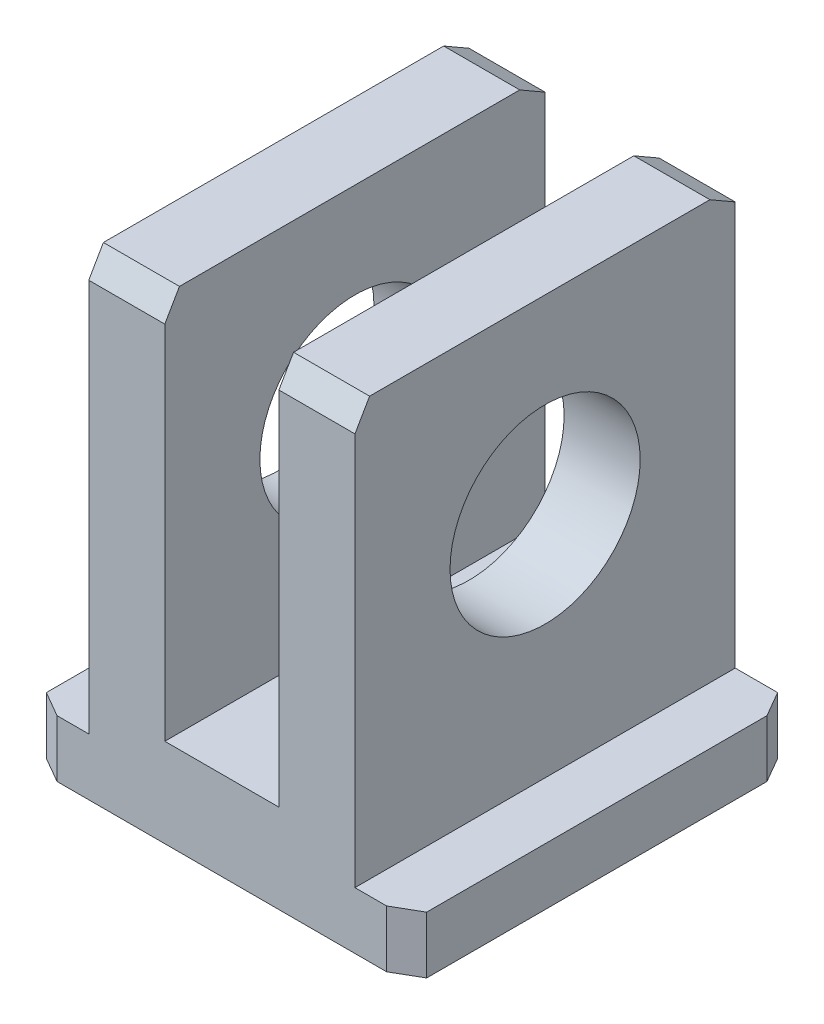
ISO-10303-21;
HEADER;
FILE_DESCRIPTION(('STEP AP214'),'2;1');
FILE_NAME('part.step','',(''),(''),'','','');
FILE_SCHEMA(('AUTOMOTIVE_DESIGN { 1 0 10303 214 1 1 1 1 }'));
ENDSEC;
DATA;
#1=APPLICATION_CONTEXT('core data for automotive mechanical design processes');
#2=APPLICATION_PROTOCOL_DEFINITION('international standard','automotive_design',2000,#1);
#3=PRODUCT_CONTEXT('',#1,'mechanical');
#4=PRODUCT('Part','Part','',(#3));
#5=PRODUCT_RELATED_PRODUCT_CATEGORY('part','',(#4));
#6=PRODUCT_DEFINITION_FORMATION('','',#4);
#7=PRODUCT_DEFINITION_CONTEXT('part definition',#1,'design');
#8=PRODUCT_DEFINITION('design','',#6,#7);
#9=PRODUCT_DEFINITION_SHAPE('','',#8);
#10=(LENGTH_UNIT() NAMED_UNIT(*) SI_UNIT(.MILLI.,.METRE.));
#11=(NAMED_UNIT(*) PLANE_ANGLE_UNIT() SI_UNIT($,.RADIAN.));
#12=(NAMED_UNIT(*) SI_UNIT($,.STERADIAN.) SOLID_ANGLE_UNIT());
#13=UNCERTAINTY_MEASURE_WITH_UNIT(LENGTH_MEASURE(1.E-05),#10,'distance_accuracy_value','');
#14=(GEOMETRIC_REPRESENTATION_CONTEXT(3) GLOBAL_UNCERTAINTY_ASSIGNED_CONTEXT((#13)) GLOBAL_UNIT_ASSIGNED_CONTEXT((#10,
#11,#12)) REPRESENTATION_CONTEXT('',''));
#15=CARTESIAN_POINT('',(0.,0.,0.));
#16=DIRECTION('',(0.,0.,1.));
#17=DIRECTION('',(1.,0.,0.));
#18=AXIS2_PLACEMENT_3D('',#15,#16,#17);
#19=CARTESIAN_POINT('',(0.,4.5,0.));
#20=DIRECTION('',(0.,0.,-1.));
#21=DIRECTION('',(-1.,0.,0.));
#22=AXIS2_PLACEMENT_3D('',#19,#20,#21);
#23=PLANE('',#22);
#24=DIRECTION('',(1.,0.,0.));
#25=VECTOR('',#24,1.);
#26=CARTESIAN_POINT('',(0.,0.,0.));
#27=LINE('',#26,#25);
#28=CARTESIAN_POINT('',(-13.,0.,0.));
#29=VERTEX_POINT('',#28);
#30=CARTESIAN_POINT('',(13.,0.,0.));
#31=VERTEX_POINT('',#30);
#32=EDGE_CURVE('E296',#29,#31,#27,.T.);
#33=ORIENTED_EDGE('',*,*,#32,.T.);
#34=DIRECTION('',(0.,1.,0.));
#35=VECTOR('',#34,1.);
#36=CARTESIAN_POINT('',(13.,4.5,0.));
#37=LINE('',#36,#35);
#38=CARTESIAN_POINT('',(13.,4.5,0.));
#39=VERTEX_POINT('',#38);
#40=EDGE_CURVE('E337',#31,#39,#37,.T.);
#41=ORIENTED_EDGE('',*,*,#40,.T.);
#42=DIRECTION('',(1.,0.,0.));
#43=VECTOR('',#42,1.);
#44=CARTESIAN_POINT('',(0.,4.5,0.));
#45=LINE('',#44,#43);
#46=CARTESIAN_POINT('',(10.5,4.5,0.));
#47=VERTEX_POINT('',#46);
#48=EDGE_CURVE('E300',#47,#39,#45,.T.);
#49=ORIENTED_EDGE('',*,*,#48,.F.);
#50=DIRECTION('',(0.,-1.,0.));
#51=VECTOR('',#50,1.);
#52=CARTESIAN_POINT('',(10.5,37.5,0.));
#53=LINE('',#52,#51);
#54=CARTESIAN_POINT('',(10.5,35.5,0.));
#55=VERTEX_POINT('',#54);
#56=EDGE_CURVE('E294',#55,#47,#53,.T.);
#57=ORIENTED_EDGE('',*,*,#56,.F.);
#58=DIRECTION('',(-1.,0.,0.));
#59=VECTOR('',#58,1.);
#60=CARTESIAN_POINT('',(4.5,35.5,0.));
#61=LINE('',#60,#59);
#62=CARTESIAN_POINT('',(4.5,35.5,0.));
#63=VERTEX_POINT('',#62);
#64=EDGE_CURVE('E335',#55,#63,#61,.T.);
#65=ORIENTED_EDGE('',*,*,#64,.T.);
#66=DIRECTION('',(0.,-1.,0.));
#67=VECTOR('',#66,1.);
#68=CARTESIAN_POINT('',(4.5,37.5,0.));
#69=LINE('',#68,#67);
#70=CARTESIAN_POINT('',(4.5,7.,0.));
#71=VERTEX_POINT('',#70);
#72=EDGE_CURVE('E288',#63,#71,#69,.T.);
#73=ORIENTED_EDGE('',*,*,#72,.T.);
#74=DIRECTION('',(1.,0.,0.));
#75=VECTOR('',#74,1.);
#76=CARTESIAN_POINT('',(0.,7.,0.));
#77=LINE('',#76,#75);
#78=CARTESIAN_POINT('',(-4.5,7.,0.));
#79=VERTEX_POINT('',#78);
#80=EDGE_CURVE('E193',#79,#71,#77,.T.);
#81=ORIENTED_EDGE('',*,*,#80,.F.);
#82=DIRECTION('',(0.,-1.,0.));
#83=VECTOR('',#82,1.);
#84=CARTESIAN_POINT('',(-4.5,37.5,0.));
#85=LINE('',#84,#83);
#86=CARTESIAN_POINT('',(-4.5,35.5,0.));
#87=VERTEX_POINT('',#86);
#88=EDGE_CURVE('E204',#87,#79,#85,.T.);
#89=ORIENTED_EDGE('',*,*,#88,.F.);
#90=DIRECTION('',(1.,0.,0.));
#91=VECTOR('',#90,1.);
#92=CARTESIAN_POINT('',(-4.5,35.5,0.));
#93=LINE('',#92,#91);
#94=CARTESIAN_POINT('',(-10.5,35.5,0.));
#95=VERTEX_POINT('',#94);
#96=EDGE_CURVE('E257',#95,#87,#93,.T.);
#97=ORIENTED_EDGE('',*,*,#96,.F.);
#98=DIRECTION('',(0.,-1.,0.));
#99=VECTOR('',#98,1.);
#100=CARTESIAN_POINT('',(-10.5,37.5,0.));
#101=LINE('',#100,#99);
#102=CARTESIAN_POINT('',(-10.5,4.5,0.));
#103=VERTEX_POINT('',#102);
#104=EDGE_CURVE('E216',#95,#103,#101,.T.);
#105=ORIENTED_EDGE('',*,*,#104,.T.);
#106=DIRECTION('',(-1.,0.,0.));
#107=VECTOR('',#106,1.);
#108=CARTESIAN_POINT('',(0.,4.5,0.));
#109=LINE('',#108,#107);
#110=CARTESIAN_POINT('',(-13.,4.5,0.));
#111=VERTEX_POINT('',#110);
#112=EDGE_CURVE('E227',#103,#111,#109,.T.);
#113=ORIENTED_EDGE('',*,*,#112,.T.);
#114=DIRECTION('',(0.,1.,0.));
#115=VECTOR('',#114,1.);
#116=CARTESIAN_POINT('',(-13.,4.5,0.));
#117=LINE('',#116,#115);
#118=EDGE_CURVE('E260',#29,#111,#117,.T.);
#119=ORIENTED_EDGE('',*,*,#118,.F.);
#120=EDGE_LOOP('',(#33,#41,#49,#57,#65,#73,#81,#89,#97,#105,#113,#119));
#121=FACE_BOUND('',#120,.T.);
#122=ADVANCED_FACE('F43',(#121),#23,.F.);
#123=CARTESIAN_POINT('',(15.,4.5,0.));
#124=DIRECTION('',(-1.,0.,0.));
#125=DIRECTION('',(0.,0.,1.));
#126=AXIS2_PLACEMENT_3D('',#123,#124,#125);
#127=PLANE('',#126);
#128=DIRECTION('',(0.,0.,-1.));
#129=VECTOR('',#128,1.);
#130=CARTESIAN_POINT('',(15.,0.,0.));
#131=LINE('',#130,#129);
#132=CARTESIAN_POINT('',(15.,0.,-1.15470053837926));
#133=VERTEX_POINT('',#132);
#134=CARTESIAN_POINT('',(15.,0.,-28.));
#135=VERTEX_POINT('',#134);
#136=EDGE_CURVE('E312',#133,#135,#131,.T.);
#137=ORIENTED_EDGE('',*,*,#136,.T.);
#138=DIRECTION('',(0.,1.,0.));
#139=VECTOR('',#138,1.);
#140=CARTESIAN_POINT('',(15.,4.5,-28.));
#141=LINE('',#140,#139);
#142=CARTESIAN_POINT('',(15.,4.5,-28.));
#143=VERTEX_POINT('',#142);
#144=EDGE_CURVE('E329',#135,#143,#141,.T.);
#145=ORIENTED_EDGE('',*,*,#144,.T.);
#146=DIRECTION('',(0.,0.,-1.));
#147=VECTOR('',#146,1.);
#148=CARTESIAN_POINT('',(15.,4.5,0.));
#149=LINE('',#148,#147);
#150=CARTESIAN_POINT('',(15.,4.5,-1.15470053837926));
#151=VERTEX_POINT('',#150);
#152=EDGE_CURVE('E304',#151,#143,#149,.T.);
#153=ORIENTED_EDGE('',*,*,#152,.F.);
#154=DIRECTION('',(0.,-1.,0.));
#155=VECTOR('',#154,1.);
#156=CARTESIAN_POINT('',(15.,4.5,-1.15470053837926));
#157=LINE('',#156,#155);
#158=EDGE_CURVE('E326',#151,#133,#157,.T.);
#159=ORIENTED_EDGE('',*,*,#158,.T.);
#160=EDGE_LOOP('',(#137,#145,#153,#159));
#161=FACE_BOUND('',#160,.T.);
#162=ADVANCED_FACE('F375',(#161),#127,.F.);
#163=CARTESIAN_POINT('',(0.,4.5,-30.));
#164=DIRECTION('',(0.,0.,-1.));
#165=DIRECTION('',(-1.,0.,0.));
#166=AXIS2_PLACEMENT_3D('',#163,#164,#165);
#167=PLANE('',#166);
#168=DIRECTION('',(1.,0.,0.));
#169=VECTOR('',#168,1.);
#170=CARTESIAN_POINT('',(0.,4.5,-30.));
#171=LINE('',#170,#169);
#172=CARTESIAN_POINT('',(10.5,4.5,-30.));
#173=VERTEX_POINT('',#172);
#174=CARTESIAN_POINT('',(13.8452994616207,4.5,-30.));
#175=VERTEX_POINT('',#174);
#176=EDGE_CURVE('E307',#173,#175,#171,.T.);
#177=ORIENTED_EDGE('',*,*,#176,.T.);
#178=DIRECTION('',(0.,-1.,0.));
#179=VECTOR('',#178,1.);
#180=CARTESIAN_POINT('',(13.8452994616207,0.,-30.));
#181=LINE('',#180,#179);
#182=CARTESIAN_POINT('',(13.8452994616207,0.,-30.));
#183=VERTEX_POINT('',#182);
#184=EDGE_CURVE('E319',#175,#183,#181,.T.);
#185=ORIENTED_EDGE('',*,*,#184,.T.);
#186=DIRECTION('',(1.,0.,0.));
#187=VECTOR('',#186,1.);
#188=CARTESIAN_POINT('',(0.,0.,-30.));
#189=LINE('',#188,#187);
#190=CARTESIAN_POINT('',(-13.8452994616207,0.,-30.));
#191=VERTEX_POINT('',#190);
#192=EDGE_CURVE('E301',#191,#183,#189,.T.);
#193=ORIENTED_EDGE('',*,*,#192,.F.);
#194=DIRECTION('',(0.,-1.,0.));
#195=VECTOR('',#194,1.);
#196=CARTESIAN_POINT('',(-13.8452994616207,0.,-30.));
#197=LINE('',#196,#195);
#198=CARTESIAN_POINT('',(-13.8452994616207,4.5,-30.));
#199=VERTEX_POINT('',#198);
#200=EDGE_CURVE('E239',#199,#191,#197,.T.);
#201=ORIENTED_EDGE('',*,*,#200,.F.);
#202=DIRECTION('',(-1.,0.,0.));
#203=VECTOR('',#202,1.);
#204=CARTESIAN_POINT('',(0.,4.5,-30.));
#205=LINE('',#204,#203);
#206=CARTESIAN_POINT('',(-10.5,4.5,-30.));
#207=VERTEX_POINT('',#206);
#208=EDGE_CURVE('E233',#207,#199,#205,.T.);
#209=ORIENTED_EDGE('',*,*,#208,.F.);
#210=DIRECTION('',(0.,-1.,0.));
#211=VECTOR('',#210,1.);
#212=CARTESIAN_POINT('',(-10.5,37.5,-30.));
#213=LINE('',#212,#211);
#214=CARTESIAN_POINT('',(-10.5,36.3452994616207,-30.));
#215=VERTEX_POINT('',#214);
#216=EDGE_CURVE('E213',#215,#207,#213,.T.);
#217=ORIENTED_EDGE('',*,*,#216,.F.);
#218=DIRECTION('',(-1.,0.,0.));
#219=VECTOR('',#218,1.);
#220=CARTESIAN_POINT('',(0.,36.3452994616207,-30.));
#221=LINE('',#220,#219);
#222=CARTESIAN_POINT('',(-4.5,36.3452994616207,-30.));
#223=VERTEX_POINT('',#222);
#224=EDGE_CURVE('E212',#223,#215,#221,.T.);
#225=ORIENTED_EDGE('',*,*,#224,.F.);
#226=DIRECTION('',(0.,-1.,0.));
#227=VECTOR('',#226,1.);
#228=CARTESIAN_POINT('',(-4.5,37.5,-30.));
#229=LINE('',#228,#227);
#230=CARTESIAN_POINT('',(-4.5,7.,-30.));
#231=VERTEX_POINT('',#230);
#232=EDGE_CURVE('E201',#223,#231,#229,.T.);
#233=ORIENTED_EDGE('',*,*,#232,.T.);
#234=DIRECTION('',(1.,0.,0.));
#235=VECTOR('',#234,1.);
#236=CARTESIAN_POINT('',(0.,7.,-30.));
#237=LINE('',#236,#235);
#238=CARTESIAN_POINT('',(4.5,7.,-30.));
#239=VERTEX_POINT('',#238);
#240=EDGE_CURVE('E182',#231,#239,#237,.T.);
#241=ORIENTED_EDGE('',*,*,#240,.T.);
#242=DIRECTION('',(0.,-1.,0.));
#243=VECTOR('',#242,1.);
#244=CARTESIAN_POINT('',(4.5,37.5,-30.));
#245=LINE('',#244,#243);
#246=CARTESIAN_POINT('',(4.5,36.3452994616207,-30.));
#247=VERTEX_POINT('',#246);
#248=EDGE_CURVE('E290',#247,#239,#245,.T.);
#249=ORIENTED_EDGE('',*,*,#248,.F.);
#250=DIRECTION('',(1.,0.,0.));
#251=VECTOR('',#250,1.);
#252=CARTESIAN_POINT('',(0.,36.3452994616207,-30.));
#253=LINE('',#252,#251);
#254=CARTESIAN_POINT('',(10.5,36.3452994616207,-30.));
#255=VERTEX_POINT('',#254);
#256=EDGE_CURVE('E309',#247,#255,#253,.T.);
#257=ORIENTED_EDGE('',*,*,#256,.T.);
#258=DIRECTION('',(0.,-1.,0.));
#259=VECTOR('',#258,1.);
#260=CARTESIAN_POINT('',(10.5,37.5,-30.));
#261=LINE('',#260,#259);
#262=EDGE_CURVE('E292',#255,#173,#261,.T.);
#263=ORIENTED_EDGE('',*,*,#262,.T.);
#264=EDGE_LOOP('',(#177,#185,#193,#201,#209,#217,#225,#233,#241,#249,#257,#263));
#265=FACE_BOUND('',#264,.T.);
#266=ADVANCED_FACE('F209',(#265),#167,.T.);
#267=CARTESIAN_POINT('',(0.,4.5,0.));
#268=DIRECTION('',(0.,1.,0.));
#269=DIRECTION('',(0.,0.,1.));
#270=AXIS2_PLACEMENT_3D('',#267,#268,#269);
#271=PLANE('',#270);
#272=ORIENTED_EDGE('',*,*,#152,.T.);
#273=DIRECTION('',(-0.499999999999999,0.,-0.86602540378444));
#274=VECTOR('',#273,1.);
#275=CARTESIAN_POINT('',(23.3743556529821,4.5,-13.4951905283832));
#276=LINE('',#275,#274);
#277=EDGE_CURVE('E333',#143,#175,#276,.T.);
#278=ORIENTED_EDGE('',*,*,#277,.T.);
#279=ORIENTED_EDGE('',*,*,#176,.F.);
#280=DIRECTION('',(0.,0.,-1.));
#281=VECTOR('',#280,1.);
#282=CARTESIAN_POINT('',(10.5,4.5,0.));
#283=LINE('',#282,#281);
#284=EDGE_CURVE('E297',#47,#173,#283,.T.);
#285=ORIENTED_EDGE('',*,*,#284,.F.);
#286=ORIENTED_EDGE('',*,*,#48,.T.);
#287=DIRECTION('',(-0.86602540378444,0.,0.499999999999999));
#288=VECTOR('',#287,1.);
#289=CARTESIAN_POINT('',(3.24999999999998,4.5,5.62916512459883));
#290=LINE('',#289,#288);
#291=EDGE_CURVE('E331',#39,#151,#290,.F.);
#292=ORIENTED_EDGE('',*,*,#291,.T.);
#293=EDGE_LOOP('',(#272,#278,#279,#285,#286,#292));
#294=FACE_BOUND('',#293,.T.);
#295=ADVANCED_FACE('F412',(#294),#271,.T.);
#296=CARTESIAN_POINT('',(0.,0.,0.));
#297=DIRECTION('',(0.,1.,0.));
#298=DIRECTION('',(0.,0.,1.));
#299=AXIS2_PLACEMENT_3D('',#296,#297,#298);
#300=PLANE('',#299);
#301=ORIENTED_EDGE('',*,*,#192,.T.);
#302=DIRECTION('',(0.499999999999999,0.,0.86602540378444));
#303=VECTOR('',#302,1.);
#304=CARTESIAN_POINT('',(13.8452994616207,0.,-30.));
#305=LINE('',#304,#303);
#306=EDGE_CURVE('E324',#183,#135,#305,.T.);
#307=ORIENTED_EDGE('',*,*,#306,.T.);
#308=ORIENTED_EDGE('',*,*,#136,.F.);
#309=DIRECTION('',(0.86602540378444,0.,-0.499999999999999));
#310=VECTOR('',#309,1.);
#311=CARTESIAN_POINT('',(15.,0.,-1.15470053837926));
#312=LINE('',#311,#310);
#313=EDGE_CURVE('E322',#133,#31,#312,.F.);
#314=ORIENTED_EDGE('',*,*,#313,.T.);
#315=ORIENTED_EDGE('',*,*,#32,.F.);
#316=DIRECTION('',(-0.86602540378444,0.,-0.499999999999999));
#317=VECTOR('',#316,1.);
#318=CARTESIAN_POINT('',(-15.,0.,-1.15470053837926));
#319=LINE('',#318,#317);
#320=CARTESIAN_POINT('',(-15.,0.,-1.15470053837926));
#321=VERTEX_POINT('',#320);
#322=EDGE_CURVE('E242',#321,#29,#319,.F.);
#323=ORIENTED_EDGE('',*,*,#322,.F.);
#324=DIRECTION('',(0.,0.,-1.));
#325=VECTOR('',#324,1.);
#326=CARTESIAN_POINT('',(-15.,0.,0.));
#327=LINE('',#326,#325);
#328=CARTESIAN_POINT('',(-15.,0.,-28.));
#329=VERTEX_POINT('',#328);
#330=EDGE_CURVE('E224',#321,#329,#327,.T.);
#331=ORIENTED_EDGE('',*,*,#330,.T.);
#332=DIRECTION('',(-0.499999999999999,0.,0.86602540378444));
#333=VECTOR('',#332,1.);
#334=CARTESIAN_POINT('',(-13.8452994616207,0.,-30.));
#335=LINE('',#334,#333);
#336=EDGE_CURVE('E245',#191,#329,#335,.T.);
#337=ORIENTED_EDGE('',*,*,#336,.F.);
#338=EDGE_LOOP('',(#301,#307,#308,#314,#315,#323,#331,#337));
#339=FACE_BOUND('',#338,.T.);
#340=ADVANCED_FACE('F421',(#339),#300,.F.);
#341=CARTESIAN_POINT('',(10.5,37.5,0.));
#342=DIRECTION('',(-1.,0.,0.));
#343=DIRECTION('',(0.,0.,1.));
#344=AXIS2_PLACEMENT_3D('',#341,#342,#343);
#345=PLANE('',#344);
#346=CARTESIAN_POINT('',(10.5,22.5,-15.));
#347=DIRECTION('',(1.,0.,0.));
#348=DIRECTION('',(0.,0.,-1.));
#349=AXIS2_PLACEMENT_3D('',#346,#347,#348);
#350=CIRCLE('',#349,7.5);
#351=CARTESIAN_POINT('',(10.5,22.5,-22.5));
#352=VERTEX_POINT('',#351);
#353=EDGE_CURVE('E194',#352,#352,#350,.T.);
#354=ORIENTED_EDGE('',*,*,#353,.F.);
#355=EDGE_LOOP('',(#354));
#356=FACE_BOUND('',#355,.T.);
#357=ORIENTED_EDGE('',*,*,#262,.F.);
#358=DIRECTION('',(0.,-0.5,-0.866025403784439));
#359=VECTOR('',#358,1.);
#360=CARTESIAN_POINT('',(10.5,36.3452994616207,-30.));
#361=LINE('',#360,#359);
#362=CARTESIAN_POINT('',(10.5,37.5,-28.));
#363=VERTEX_POINT('',#362);
#364=EDGE_CURVE('E341',#255,#363,#361,.F.);
#365=ORIENTED_EDGE('',*,*,#364,.T.);
#366=DIRECTION('',(0.,0.,-1.));
#367=VECTOR('',#366,1.);
#368=CARTESIAN_POINT('',(10.5,37.5,0.));
#369=LINE('',#368,#367);
#370=CARTESIAN_POINT('',(10.5,37.5,-1.15470053837926));
#371=VERTEX_POINT('',#370);
#372=EDGE_CURVE('E284',#371,#363,#369,.T.);
#373=ORIENTED_EDGE('',*,*,#372,.F.);
#374=DIRECTION('',(0.,-0.86602540378444,0.499999999999999));
#375=VECTOR('',#374,1.);
#376=CARTESIAN_POINT('',(10.5,37.5,-1.15470053837926));
#377=LINE('',#376,#375);
#378=EDGE_CURVE('E339',#371,#55,#377,.T.);
#379=ORIENTED_EDGE('',*,*,#378,.T.);
#380=ORIENTED_EDGE('',*,*,#56,.T.);
#381=ORIENTED_EDGE('',*,*,#284,.T.);
#382=EDGE_LOOP('',(#357,#365,#373,#379,#380,#381));
#383=FACE_BOUND('',#382,.T.);
#384=ADVANCED_FACE('F352',(#356,#383),#345,.F.);
#385=CARTESIAN_POINT('',(4.5,37.5,0.));
#386=DIRECTION('',(-1.,0.,0.));
#387=DIRECTION('',(0.,0.,1.));
#388=AXIS2_PLACEMENT_3D('',#385,#386,#387);
#389=PLANE('',#388);
#390=CARTESIAN_POINT('',(4.5,22.5,-15.));
#391=DIRECTION('',(-1.,0.,0.));
#392=DIRECTION('',(0.,0.,1.));
#393=AXIS2_PLACEMENT_3D('',#390,#391,#392);
#394=CIRCLE('',#393,7.5);
#395=CARTESIAN_POINT('',(4.5,22.5,-7.5));
#396=VERTEX_POINT('',#395);
#397=EDGE_CURVE('E277',#396,#396,#394,.F.);
#398=ORIENTED_EDGE('',*,*,#397,.T.);
#399=EDGE_LOOP('',(#398));
#400=FACE_BOUND('',#399,.T.);
#401=DIRECTION('',(0.,0.,-1.));
#402=VECTOR('',#401,1.);
#403=CARTESIAN_POINT('',(4.5,37.5,0.));
#404=LINE('',#403,#402);
#405=CARTESIAN_POINT('',(4.5,37.5,-1.15470053837926));
#406=VERTEX_POINT('',#405);
#407=CARTESIAN_POINT('',(4.5,37.5,-28.));
#408=VERTEX_POINT('',#407);
#409=EDGE_CURVE('E286',#406,#408,#404,.T.);
#410=ORIENTED_EDGE('',*,*,#409,.T.);
#411=DIRECTION('',(0.,0.5,0.866025403784439));
#412=VECTOR('',#411,1.);
#413=CARTESIAN_POINT('',(4.5,49.6243556529821,-6.99999999999998));
#414=LINE('',#413,#412);
#415=EDGE_CURVE('E11',#408,#247,#414,.F.);
#416=ORIENTED_EDGE('',*,*,#415,.T.);
#417=ORIENTED_EDGE('',*,*,#248,.T.);
#418=DIRECTION('',(0.,0.,-1.));
#419=VECTOR('',#418,1.);
#420=CARTESIAN_POINT('',(4.5,7.,0.));
#421=LINE('',#420,#419);
#422=EDGE_CURVE('E189',#71,#239,#421,.T.);
#423=ORIENTED_EDGE('',*,*,#422,.F.);
#424=ORIENTED_EDGE('',*,*,#72,.F.);
#425=DIRECTION('',(0.,0.86602540378444,-0.499999999999999));
#426=VECTOR('',#425,1.);
#427=CARTESIAN_POINT('',(4.5,37.,-0.866025403784444));
#428=LINE('',#427,#426);
#429=EDGE_CURVE('E52',#63,#406,#428,.T.);
#430=ORIENTED_EDGE('',*,*,#429,.T.);
#431=EDGE_LOOP('',(#410,#416,#417,#423,#424,#430));
#432=FACE_BOUND('',#431,.T.);
#433=ADVANCED_FACE('F359',(#400,#432),#389,.T.);
#434=CARTESIAN_POINT('',(0.,37.5,0.));
#435=DIRECTION('',(0.,1.,0.));
#436=DIRECTION('',(0.,0.,1.));
#437=AXIS2_PLACEMENT_3D('',#434,#435,#436);
#438=PLANE('',#437);
#439=ORIENTED_EDGE('',*,*,#372,.T.);
#440=DIRECTION('',(-1.,0.,0.));
#441=VECTOR('',#440,1.);
#442=CARTESIAN_POINT('',(0.,37.5,-28.));
#443=LINE('',#442,#441);
#444=EDGE_CURVE('E59',#363,#408,#443,.T.);
#445=ORIENTED_EDGE('',*,*,#444,.T.);
#446=ORIENTED_EDGE('',*,*,#409,.F.);
#447=DIRECTION('',(1.,0.,0.));
#448=VECTOR('',#447,1.);
#449=CARTESIAN_POINT('',(10.5,37.5,-1.15470053837926));
#450=LINE('',#449,#448);
#451=EDGE_CURVE('E343',#406,#371,#450,.T.);
#452=ORIENTED_EDGE('',*,*,#451,.T.);
#453=EDGE_LOOP('',(#439,#445,#446,#452));
#454=FACE_BOUND('',#453,.T.);
#455=ADVANCED_FACE('F348',(#454),#438,.T.);
#456=CARTESIAN_POINT('',(0.,7.,0.));
#457=DIRECTION('',(0.,1.,0.));
#458=DIRECTION('',(0.,0.,1.));
#459=AXIS2_PLACEMENT_3D('',#456,#457,#458);
#460=PLANE('',#459);
#461=ORIENTED_EDGE('',*,*,#240,.F.);
#462=DIRECTION('',(0.,0.,-1.));
#463=VECTOR('',#462,1.);
#464=CARTESIAN_POINT('',(-4.5,7.,0.));
#465=LINE('',#464,#463);
#466=EDGE_CURVE('E186',#79,#231,#465,.T.);
#467=ORIENTED_EDGE('',*,*,#466,.F.);
#468=ORIENTED_EDGE('',*,*,#80,.T.);
#469=ORIENTED_EDGE('',*,*,#422,.T.);
#470=EDGE_LOOP('',(#461,#467,#468,#469));
#471=FACE_BOUND('',#470,.T.);
#472=ADVANCED_FACE('F184',(#471),#460,.T.);
#473=CARTESIAN_POINT('',(-0.000999999999999265,22.5,-15.));
#474=DIRECTION('',(1.,0.,0.));
#475=DIRECTION('',(0.,0.,-1.));
#476=AXIS2_PLACEMENT_3D('',#473,#474,#475);
#477=CYLINDRICAL_SURFACE('',#476,7.5);
#478=ORIENTED_EDGE('',*,*,#397,.F.);
#479=EDGE_LOOP('',(#478));
#480=FACE_BOUND('',#479,.T.);
#481=ORIENTED_EDGE('',*,*,#353,.T.);
#482=EDGE_LOOP('',(#481));
#483=FACE_BOUND('',#482,.T.);
#484=ADVANCED_FACE('F393',(#480,#483),#477,.F.);
#485=CARTESIAN_POINT('',(13.8452994616207,4.5,-30.));
#486=DIRECTION('',(0.86602540378444,0.,-0.499999999999999));
#487=DIRECTION('',(0.,1.,0.));
#488=AXIS2_PLACEMENT_3D('',#485,#486,#487);
#489=PLANE('',#488);
#490=ORIENTED_EDGE('',*,*,#277,.F.);
#491=ORIENTED_EDGE('',*,*,#144,.F.);
#492=ORIENTED_EDGE('',*,*,#306,.F.);
#493=ORIENTED_EDGE('',*,*,#184,.F.);
#494=EDGE_LOOP('',(#490,#491,#492,#493));
#495=FACE_BOUND('',#494,.T.);
#496=ADVANCED_FACE('F387',(#495),#489,.T.);
#497=CARTESIAN_POINT('',(15.,4.5,-1.15470053837926));
#498=DIRECTION('',(-0.499999999999999,0.,-0.86602540378444));
#499=DIRECTION('',(0.,-1.,0.));
#500=AXIS2_PLACEMENT_3D('',#497,#498,#499);
#501=PLANE('',#500);
#502=ORIENTED_EDGE('',*,*,#291,.F.);
#503=ORIENTED_EDGE('',*,*,#40,.F.);
#504=ORIENTED_EDGE('',*,*,#313,.F.);
#505=ORIENTED_EDGE('',*,*,#158,.F.);
#506=EDGE_LOOP('',(#502,#503,#504,#505));
#507=FACE_BOUND('',#506,.T.);
#508=ADVANCED_FACE('F373',(#507),#501,.F.);
#509=CARTESIAN_POINT('',(0.,36.3452994616207,-30.));
#510=DIRECTION('',(0.,-0.866025403784439,0.5));
#511=DIRECTION('',(1.,0.,0.));
#512=AXIS2_PLACEMENT_3D('',#509,#510,#511);
#513=PLANE('',#512);
#514=ORIENTED_EDGE('',*,*,#415,.F.);
#515=ORIENTED_EDGE('',*,*,#444,.F.);
#516=ORIENTED_EDGE('',*,*,#364,.F.);
#517=ORIENTED_EDGE('',*,*,#256,.F.);
#518=EDGE_LOOP('',(#514,#515,#516,#517));
#519=FACE_BOUND('',#518,.T.);
#520=ADVANCED_FACE('F357',(#519),#513,.F.);
#521=CARTESIAN_POINT('',(0.,37.5,-1.15470053837926));
#522=DIRECTION('',(0.,0.499999999999999,0.86602540378444));
#523=DIRECTION('',(-1.,0.,0.));
#524=AXIS2_PLACEMENT_3D('',#521,#522,#523);
#525=PLANE('',#524);
#526=ORIENTED_EDGE('',*,*,#429,.F.);
#527=ORIENTED_EDGE('',*,*,#64,.F.);
#528=ORIENTED_EDGE('',*,*,#378,.F.);
#529=ORIENTED_EDGE('',*,*,#451,.F.);
#530=EDGE_LOOP('',(#526,#527,#528,#529));
#531=FACE_BOUND('',#530,.T.);
#532=ADVANCED_FACE('F46',(#531),#525,.T.);
#533=CARTESIAN_POINT('',(-15.,4.5,0.));
#534=DIRECTION('',(1.,0.,0.));
#535=DIRECTION('',(0.,0.,1.));
#536=AXIS2_PLACEMENT_3D('',#533,#534,#535);
#537=PLANE('',#536);
#538=ORIENTED_EDGE('',*,*,#330,.F.);
#539=DIRECTION('',(0.,-1.,0.));
#540=VECTOR('',#539,1.);
#541=CARTESIAN_POINT('',(-15.,4.5,-1.15470053837926));
#542=LINE('',#541,#540);
#543=CARTESIAN_POINT('',(-15.,4.5,-1.15470053837926));
#544=VERTEX_POINT('',#543);
#545=EDGE_CURVE('E247',#544,#321,#542,.T.);
#546=ORIENTED_EDGE('',*,*,#545,.F.);
#547=DIRECTION('',(0.,0.,-1.));
#548=VECTOR('',#547,1.);
#549=CARTESIAN_POINT('',(-15.,4.5,0.));
#550=LINE('',#549,#548);
#551=CARTESIAN_POINT('',(-15.,4.5,-28.));
#552=VERTEX_POINT('',#551);
#553=EDGE_CURVE('E230',#544,#552,#550,.T.);
#554=ORIENTED_EDGE('',*,*,#553,.T.);
#555=DIRECTION('',(0.,1.,0.));
#556=VECTOR('',#555,1.);
#557=CARTESIAN_POINT('',(-15.,4.5,-28.));
#558=LINE('',#557,#556);
#559=EDGE_CURVE('E250',#329,#552,#558,.T.);
#560=ORIENTED_EDGE('',*,*,#559,.F.);
#561=EDGE_LOOP('',(#538,#546,#554,#560));
#562=FACE_BOUND('',#561,.T.);
#563=ADVANCED_FACE('F365',(#562),#537,.F.);
#564=CARTESIAN_POINT('',(0.,4.5,0.));
#565=DIRECTION('',(0.,1.,0.));
#566=DIRECTION('',(0.,0.,1.));
#567=AXIS2_PLACEMENT_3D('',#564,#565,#566);
#568=PLANE('',#567);
#569=ORIENTED_EDGE('',*,*,#553,.F.);
#570=DIRECTION('',(0.86602540378444,0.,0.499999999999999));
#571=VECTOR('',#570,1.);
#572=CARTESIAN_POINT('',(-3.24999999999998,4.5,5.62916512459883));
#573=LINE('',#572,#571);
#574=EDGE_CURVE('E253',#111,#544,#573,.F.);
#575=ORIENTED_EDGE('',*,*,#574,.F.);
#576=ORIENTED_EDGE('',*,*,#112,.F.);
#577=DIRECTION('',(0.,0.,-1.));
#578=VECTOR('',#577,1.);
#579=CARTESIAN_POINT('',(-10.5,4.5,0.));
#580=LINE('',#579,#578);
#581=EDGE_CURVE('E225',#103,#207,#580,.T.);
#582=ORIENTED_EDGE('',*,*,#581,.T.);
#583=ORIENTED_EDGE('',*,*,#208,.T.);
#584=DIRECTION('',(0.499999999999999,0.,-0.86602540378444));
#585=VECTOR('',#584,1.);
#586=CARTESIAN_POINT('',(-23.3743556529821,4.5,-13.4951905283832));
#587=LINE('',#586,#585);
#588=EDGE_CURVE('E255',#552,#199,#587,.T.);
#589=ORIENTED_EDGE('',*,*,#588,.F.);
#590=EDGE_LOOP('',(#569,#575,#576,#582,#583,#589));
#591=FACE_BOUND('',#590,.T.);
#592=ADVANCED_FACE('F370',(#591),#568,.T.);
#593=CARTESIAN_POINT('',(-10.5,37.5,0.));
#594=DIRECTION('',(1.,0.,0.));
#595=DIRECTION('',(0.,0.,1.));
#596=AXIS2_PLACEMENT_3D('',#593,#594,#595);
#597=PLANE('',#596);
#598=CARTESIAN_POINT('',(-10.5,22.5,-15.));
#599=DIRECTION('',(1.,0.,0.));
#600=DIRECTION('',(0.,0.,-1.));
#601=AXIS2_PLACEMENT_3D('',#598,#599,#600);
#602=CIRCLE('',#601,7.5);
#603=CARTESIAN_POINT('',(-10.5,22.5,-22.5));
#604=VERTEX_POINT('',#603);
#605=EDGE_CURVE('E206',#604,#604,#602,.T.);
#606=ORIENTED_EDGE('',*,*,#605,.T.);
#607=EDGE_LOOP('',(#606));
#608=FACE_BOUND('',#607,.T.);
#609=ORIENTED_EDGE('',*,*,#216,.T.);
#610=ORIENTED_EDGE('',*,*,#581,.F.);
#611=ORIENTED_EDGE('',*,*,#104,.F.);
#612=DIRECTION('',(0.,-0.86602540378444,0.499999999999999));
#613=VECTOR('',#612,1.);
#614=CARTESIAN_POINT('',(-10.5,37.5,-1.15470053837926));
#615=LINE('',#614,#613);
#616=CARTESIAN_POINT('',(-10.5,37.5,-1.15470053837926));
#617=VERTEX_POINT('',#616);
#618=EDGE_CURVE('E263',#617,#95,#615,.T.);
#619=ORIENTED_EDGE('',*,*,#618,.F.);
#620=DIRECTION('',(0.,0.,-1.));
#621=VECTOR('',#620,1.);
#622=CARTESIAN_POINT('',(-10.5,37.5,0.));
#623=LINE('',#622,#621);
#624=CARTESIAN_POINT('',(-10.5,37.5,-28.));
#625=VERTEX_POINT('',#624);
#626=EDGE_CURVE('E205',#617,#625,#623,.T.);
#627=ORIENTED_EDGE('',*,*,#626,.T.);
#628=DIRECTION('',(0.,-0.5,-0.866025403784439));
#629=VECTOR('',#628,1.);
#630=CARTESIAN_POINT('',(-10.5,36.3452994616207,-30.));
#631=LINE('',#630,#629);
#632=EDGE_CURVE('E265',#215,#625,#631,.F.);
#633=ORIENTED_EDGE('',*,*,#632,.F.);
#634=EDGE_LOOP('',(#609,#610,#611,#619,#627,#633));
#635=FACE_BOUND('',#634,.T.);
#636=ADVANCED_FACE('F432',(#608,#635),#597,.F.);
#637=CARTESIAN_POINT('',(-4.5,37.5,0.));
#638=DIRECTION('',(1.,0.,0.));
#639=DIRECTION('',(0.,0.,1.));
#640=AXIS2_PLACEMENT_3D('',#637,#638,#639);
#641=PLANE('',#640);
#642=CARTESIAN_POINT('',(-4.5,22.5,-15.));
#643=DIRECTION('',(-1.,0.,0.));
#644=DIRECTION('',(0.,0.,1.));
#645=AXIS2_PLACEMENT_3D('',#642,#643,#644);
#646=CIRCLE('',#645,7.5);
#647=CARTESIAN_POINT('',(-4.5,22.5,-7.5));
#648=VERTEX_POINT('',#647);
#649=EDGE_CURVE('E443',#648,#648,#646,.F.);
#650=ORIENTED_EDGE('',*,*,#649,.F.);
#651=EDGE_LOOP('',(#650));
#652=FACE_BOUND('',#651,.T.);
#653=DIRECTION('',(0.,0.,-1.));
#654=VECTOR('',#653,1.);
#655=CARTESIAN_POINT('',(-4.5,37.5,0.));
#656=LINE('',#655,#654);
#657=CARTESIAN_POINT('',(-4.5,37.5,-1.15470053837926));
#658=VERTEX_POINT('',#657);
#659=CARTESIAN_POINT('',(-4.5,37.5,-28.));
#660=VERTEX_POINT('',#659);
#661=EDGE_CURVE('E218',#658,#660,#656,.T.);
#662=ORIENTED_EDGE('',*,*,#661,.F.);
#663=DIRECTION('',(0.,0.86602540378444,-0.499999999999999));
#664=VECTOR('',#663,1.);
#665=CARTESIAN_POINT('',(-4.5,37.,-0.866025403784444));
#666=LINE('',#665,#664);
#667=EDGE_CURVE('E272',#87,#658,#666,.T.);
#668=ORIENTED_EDGE('',*,*,#667,.F.);
#669=ORIENTED_EDGE('',*,*,#88,.T.);
#670=ORIENTED_EDGE('',*,*,#466,.T.);
#671=ORIENTED_EDGE('',*,*,#232,.F.);
#672=DIRECTION('',(0.,0.5,0.866025403784439));
#673=VECTOR('',#672,1.);
#674=CARTESIAN_POINT('',(-4.5,49.6243556529821,-6.99999999999998));
#675=LINE('',#674,#673);
#676=EDGE_CURVE('E275',#660,#223,#675,.F.);
#677=ORIENTED_EDGE('',*,*,#676,.F.);
#678=EDGE_LOOP('',(#662,#668,#669,#670,#671,#677));
#679=FACE_BOUND('',#678,.T.);
#680=ADVANCED_FACE('F199',(#652,#679),#641,.T.);
#681=CARTESIAN_POINT('',(0.,37.5,0.));
#682=DIRECTION('',(0.,1.,0.));
#683=DIRECTION('',(0.,0.,1.));
#684=AXIS2_PLACEMENT_3D('',#681,#682,#683);
#685=PLANE('',#684);
#686=ORIENTED_EDGE('',*,*,#626,.F.);
#687=DIRECTION('',(-1.,0.,0.));
#688=VECTOR('',#687,1.);
#689=CARTESIAN_POINT('',(-10.5,37.5,-1.15470053837926));
#690=LINE('',#689,#688);
#691=EDGE_CURVE('E268',#658,#617,#690,.T.);
#692=ORIENTED_EDGE('',*,*,#691,.F.);
#693=ORIENTED_EDGE('',*,*,#661,.T.);
#694=DIRECTION('',(1.,0.,0.));
#695=VECTOR('',#694,1.);
#696=CARTESIAN_POINT('',(0.,37.5,-28.));
#697=LINE('',#696,#695);
#698=EDGE_CURVE('E270',#625,#660,#697,.T.);
#699=ORIENTED_EDGE('',*,*,#698,.F.);
#700=EDGE_LOOP('',(#686,#692,#693,#699));
#701=FACE_BOUND('',#700,.T.);
#702=ADVANCED_FACE('F440',(#701),#685,.T.);
#703=CARTESIAN_POINT('',(0.000999999999999265,22.5,-15.));
#704=DIRECTION('',(-1.,0.,0.));
#705=DIRECTION('',(0.,0.,-1.));
#706=AXIS2_PLACEMENT_3D('',#703,#704,#705);
#707=CYLINDRICAL_SURFACE('',#706,7.5);
#708=ORIENTED_EDGE('',*,*,#649,.T.);
#709=EDGE_LOOP('',(#708));
#710=FACE_BOUND('',#709,.T.);
#711=ORIENTED_EDGE('',*,*,#605,.F.);
#712=EDGE_LOOP('',(#711));
#713=FACE_BOUND('',#712,.T.);
#714=ADVANCED_FACE('F450',(#710,#713),#707,.F.);
#715=CARTESIAN_POINT('',(-13.8452994616207,4.5,-30.));
#716=DIRECTION('',(-0.86602540378444,0.,-0.499999999999999));
#717=DIRECTION('',(0.,1.,0.));
#718=AXIS2_PLACEMENT_3D('',#715,#716,#717);
#719=PLANE('',#718);
#720=ORIENTED_EDGE('',*,*,#588,.T.);
#721=ORIENTED_EDGE('',*,*,#200,.T.);
#722=ORIENTED_EDGE('',*,*,#336,.T.);
#723=ORIENTED_EDGE('',*,*,#559,.T.);
#724=EDGE_LOOP('',(#720,#721,#722,#723));
#725=FACE_BOUND('',#724,.T.);
#726=ADVANCED_FACE('F425',(#725),#719,.T.);
#727=CARTESIAN_POINT('',(-15.,4.5,-1.15470053837926));
#728=DIRECTION('',(0.499999999999999,0.,-0.86602540378444));
#729=DIRECTION('',(0.,-1.,0.));
#730=AXIS2_PLACEMENT_3D('',#727,#728,#729);
#731=PLANE('',#730);
#732=ORIENTED_EDGE('',*,*,#574,.T.);
#733=ORIENTED_EDGE('',*,*,#545,.T.);
#734=ORIENTED_EDGE('',*,*,#322,.T.);
#735=ORIENTED_EDGE('',*,*,#118,.T.);
#736=EDGE_LOOP('',(#732,#733,#734,#735));
#737=FACE_BOUND('',#736,.T.);
#738=ADVANCED_FACE('F458',(#737),#731,.F.);
#739=CARTESIAN_POINT('',(0.,36.3452994616207,-30.));
#740=DIRECTION('',(0.,-0.866025403784439,0.5));
#741=DIRECTION('',(-1.,0.,0.));
#742=AXIS2_PLACEMENT_3D('',#739,#740,#741);
#743=PLANE('',#742);
#744=ORIENTED_EDGE('',*,*,#676,.T.);
#745=ORIENTED_EDGE('',*,*,#224,.T.);
#746=ORIENTED_EDGE('',*,*,#632,.T.);
#747=ORIENTED_EDGE('',*,*,#698,.T.);
#748=EDGE_LOOP('',(#744,#745,#746,#747));
#749=FACE_BOUND('',#748,.T.);
#750=ADVANCED_FACE('F437',(#749),#743,.F.);
#751=CARTESIAN_POINT('',(0.,37.5,-1.15470053837926));
#752=DIRECTION('',(0.,0.499999999999999,0.86602540378444));
#753=DIRECTION('',(1.,0.,0.));
#754=AXIS2_PLACEMENT_3D('',#751,#752,#753);
#755=PLANE('',#754);
#756=ORIENTED_EDGE('',*,*,#667,.T.);
#757=ORIENTED_EDGE('',*,*,#691,.T.);
#758=ORIENTED_EDGE('',*,*,#618,.T.);
#759=ORIENTED_EDGE('',*,*,#96,.T.);
#760=EDGE_LOOP('',(#756,#757,#758,#759));
#761=FACE_BOUND('',#760,.T.);
#762=ADVANCED_FACE('F474',(#761),#755,.T.);
#763=CLOSED_SHELL('',(#122,#162,#266,#295,#340,#384,#433,#455,#472,#484,#496,#508,#520,#532,
#563,#592,#636,#680,#702,#714,#726,#738,#750,#762));
#764=MANIFOLD_SOLID_BREP('B2',#763);
#765=ADVANCED_BREP_SHAPE_REPRESENTATION('',(#18,#764),#14);
#766=SHAPE_DEFINITION_REPRESENTATION(#9,#765);
ENDSEC;
END-ISO-10303-21;
